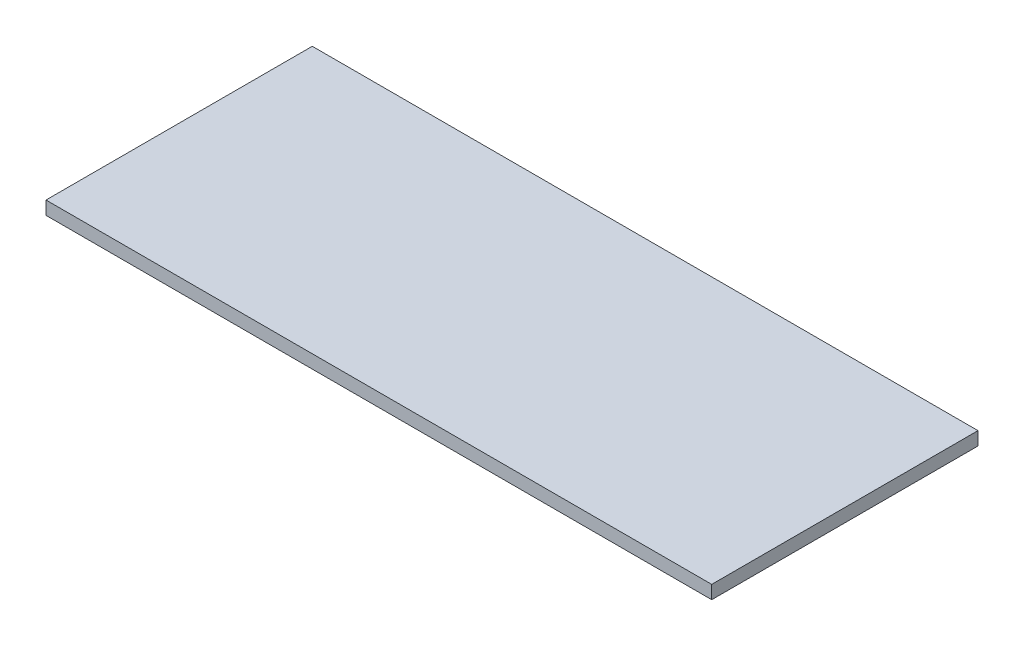
ISO-10303-21;
HEADER;
FILE_DESCRIPTION(('STEP AP214'),'2;1');
FILE_NAME('part.step','',(''),(''),'','','');
FILE_SCHEMA(('AUTOMOTIVE_DESIGN { 1 0 10303 214 1 1 1 1 }'));
ENDSEC;
DATA;
#1=APPLICATION_CONTEXT('core data for automotive mechanical design processes');
#2=APPLICATION_PROTOCOL_DEFINITION('international standard','automotive_design',2000,#1);
#3=PRODUCT_CONTEXT('',#1,'mechanical');
#4=PRODUCT('Part','Part','',(#3));
#5=PRODUCT_RELATED_PRODUCT_CATEGORY('part','',(#4));
#6=PRODUCT_DEFINITION_FORMATION('','',#4);
#7=PRODUCT_DEFINITION_CONTEXT('part definition',#1,'design');
#8=PRODUCT_DEFINITION('design','',#6,#7);
#9=PRODUCT_DEFINITION_SHAPE('','',#8);
#10=(LENGTH_UNIT() NAMED_UNIT(*) SI_UNIT(.MILLI.,.METRE.));
#11=(NAMED_UNIT(*) PLANE_ANGLE_UNIT() SI_UNIT($,.RADIAN.));
#12=(NAMED_UNIT(*) SI_UNIT($,.STERADIAN.) SOLID_ANGLE_UNIT());
#13=UNCERTAINTY_MEASURE_WITH_UNIT(LENGTH_MEASURE(1.E-05),#10,'distance_accuracy_value','');
#14=(GEOMETRIC_REPRESENTATION_CONTEXT(3) GLOBAL_UNCERTAINTY_ASSIGNED_CONTEXT((#13)) GLOBAL_UNIT_ASSIGNED_CONTEXT((#10,
#11,#12)) REPRESENTATION_CONTEXT('',''));
#15=CARTESIAN_POINT('',(0.,0.,0.));
#16=DIRECTION('',(0.,0.,1.));
#17=DIRECTION('',(1.,0.,0.));
#18=AXIS2_PLACEMENT_3D('',#15,#16,#17);
#19=CARTESIAN_POINT('',(100.,4.,40.));
#20=DIRECTION('',(-1.,0.,0.));
#21=DIRECTION('',(0.,0.,1.));
#22=AXIS2_PLACEMENT_3D('',#19,#20,#21);
#23=PLANE('',#22);
#24=DIRECTION('',(0.,0.,-1.));
#25=VECTOR('',#24,1.);
#26=CARTESIAN_POINT('',(100.,0.,40.));
#27=LINE('',#26,#25);
#28=CARTESIAN_POINT('',(100.,0.,40.));
#29=VERTEX_POINT('',#28);
#30=CARTESIAN_POINT('',(100.,0.,-40.));
#31=VERTEX_POINT('',#30);
#32=EDGE_CURVE('E98',#29,#31,#27,.T.);
#33=ORIENTED_EDGE('',*,*,#32,.T.);
#34=DIRECTION('',(0.,-1.,0.));
#35=VECTOR('',#34,1.);
#36=CARTESIAN_POINT('',(100.,4.,-40.));
#37=LINE('',#36,#35);
#38=CARTESIAN_POINT('',(100.,4.,-40.));
#39=VERTEX_POINT('',#38);
#40=EDGE_CURVE('E11',#39,#31,#37,.T.);
#41=ORIENTED_EDGE('',*,*,#40,.F.);
#42=DIRECTION('',(0.,0.,-1.));
#43=VECTOR('',#42,1.);
#44=CARTESIAN_POINT('',(100.,4.,40.));
#45=LINE('',#44,#43);
#46=CARTESIAN_POINT('',(100.,4.,40.));
#47=VERTEX_POINT('',#46);
#48=EDGE_CURVE('E86',#47,#39,#45,.T.);
#49=ORIENTED_EDGE('',*,*,#48,.F.);
#50=DIRECTION('',(0.,-1.,0.));
#51=VECTOR('',#50,1.);
#52=CARTESIAN_POINT('',(100.,4.,40.));
#53=LINE('',#52,#51);
#54=EDGE_CURVE('E94',#47,#29,#53,.T.);
#55=ORIENTED_EDGE('',*,*,#54,.T.);
#56=EDGE_LOOP('',(#33,#41,#49,#55));
#57=FACE_BOUND('',#56,.T.);
#58=ADVANCED_FACE('F35',(#57),#23,.F.);
#59=CARTESIAN_POINT('',(-99.9999999999999,4.,-40.));
#60=DIRECTION('',(0.,0.,1.));
#61=DIRECTION('',(1.,0.,0.));
#62=AXIS2_PLACEMENT_3D('',#59,#60,#61);
#63=PLANE('',#62);
#64=DIRECTION('',(-1.,0.,0.));
#65=VECTOR('',#64,1.);
#66=CARTESIAN_POINT('',(-99.9999999999999,0.,-40.));
#67=LINE('',#66,#65);
#68=CARTESIAN_POINT('',(-99.9999999999999,0.,-40.));
#69=VERTEX_POINT('',#68);
#70=EDGE_CURVE('E90',#31,#69,#67,.T.);
#71=ORIENTED_EDGE('',*,*,#70,.T.);
#72=DIRECTION('',(0.,-1.,0.));
#73=VECTOR('',#72,1.);
#74=CARTESIAN_POINT('',(-99.9999999999999,4.,-40.));
#75=LINE('',#74,#73);
#76=CARTESIAN_POINT('',(-99.9999999999999,4.,-40.));
#77=VERTEX_POINT('',#76);
#78=EDGE_CURVE('E43',#77,#69,#75,.T.);
#79=ORIENTED_EDGE('',*,*,#78,.F.);
#80=DIRECTION('',(-1.,0.,0.));
#81=VECTOR('',#80,1.);
#82=CARTESIAN_POINT('',(-99.9999999999999,4.,-40.));
#83=LINE('',#82,#81);
#84=EDGE_CURVE('E81',#39,#77,#83,.T.);
#85=ORIENTED_EDGE('',*,*,#84,.F.);
#86=ORIENTED_EDGE('',*,*,#40,.T.);
#87=EDGE_LOOP('',(#71,#79,#85,#86));
#88=FACE_BOUND('',#87,.T.);
#89=ADVANCED_FACE('F89',(#88),#63,.F.);
#90=CARTESIAN_POINT('',(-99.9999999999999,4.,40.));
#91=DIRECTION('',(1.,0.,0.));
#92=DIRECTION('',(0.,0.,-1.));
#93=AXIS2_PLACEMENT_3D('',#90,#91,#92);
#94=PLANE('',#93);
#95=DIRECTION('',(0.,0.,1.));
#96=VECTOR('',#95,1.);
#97=CARTESIAN_POINT('',(-99.9999999999999,0.,40.));
#98=LINE('',#97,#96);
#99=CARTESIAN_POINT('',(-99.9999999999999,0.,40.));
#100=VERTEX_POINT('',#99);
#101=EDGE_CURVE('E68',#69,#100,#98,.T.);
#102=ORIENTED_EDGE('',*,*,#101,.T.);
#103=DIRECTION('',(0.,-1.,0.));
#104=VECTOR('',#103,1.);
#105=CARTESIAN_POINT('',(-99.9999999999999,4.,40.));
#106=LINE('',#105,#104);
#107=CARTESIAN_POINT('',(-99.9999999999999,4.,40.));
#108=VERTEX_POINT('',#107);
#109=EDGE_CURVE('E91',#108,#100,#106,.T.);
#110=ORIENTED_EDGE('',*,*,#109,.F.);
#111=DIRECTION('',(0.,0.,1.));
#112=VECTOR('',#111,1.);
#113=CARTESIAN_POINT('',(-99.9999999999999,4.,40.));
#114=LINE('',#113,#112);
#115=EDGE_CURVE('E84',#77,#108,#114,.T.);
#116=ORIENTED_EDGE('',*,*,#115,.F.);
#117=ORIENTED_EDGE('',*,*,#78,.T.);
#118=EDGE_LOOP('',(#102,#110,#116,#117));
#119=FACE_BOUND('',#118,.T.);
#120=ADVANCED_FACE('F92',(#119),#94,.F.);
#121=CARTESIAN_POINT('',(-99.9999999999999,4.,40.));
#122=DIRECTION('',(0.,0.,-1.));
#123=DIRECTION('',(-1.,0.,0.));
#124=AXIS2_PLACEMENT_3D('',#121,#122,#123);
#125=PLANE('',#124);
#126=DIRECTION('',(1.,0.,0.));
#127=VECTOR('',#126,1.);
#128=CARTESIAN_POINT('',(-99.9999999999999,0.,40.));
#129=LINE('',#128,#127);
#130=EDGE_CURVE('E74',#100,#29,#129,.T.);
#131=ORIENTED_EDGE('',*,*,#130,.T.);
#132=ORIENTED_EDGE('',*,*,#54,.F.);
#133=DIRECTION('',(1.,0.,0.));
#134=VECTOR('',#133,1.);
#135=CARTESIAN_POINT('',(-99.9999999999999,4.,40.));
#136=LINE('',#135,#134);
#137=EDGE_CURVE('E51',#108,#47,#136,.T.);
#138=ORIENTED_EDGE('',*,*,#137,.F.);
#139=ORIENTED_EDGE('',*,*,#109,.T.);
#140=EDGE_LOOP('',(#131,#132,#138,#139));
#141=FACE_BOUND('',#140,.T.);
#142=ADVANCED_FACE('F105',(#141),#125,.F.);
#143=CARTESIAN_POINT('',(0.,4.,0.));
#144=DIRECTION('',(0.,-1.,0.));
#145=DIRECTION('',(0.,0.,-1.));
#146=AXIS2_PLACEMENT_3D('',#143,#144,#145);
#147=PLANE('',#146);
#148=ORIENTED_EDGE('',*,*,#48,.T.);
#149=ORIENTED_EDGE('',*,*,#84,.T.);
#150=ORIENTED_EDGE('',*,*,#115,.T.);
#151=ORIENTED_EDGE('',*,*,#137,.T.);
#152=EDGE_LOOP('',(#148,#149,#150,#151));
#153=FACE_BOUND('',#152,.T.);
#154=ADVANCED_FACE('F82',(#153),#147,.F.);
#155=CARTESIAN_POINT('',(0.,0.,0.));
#156=DIRECTION('',(0.,-1.,0.));
#157=DIRECTION('',(0.,0.,-1.));
#158=AXIS2_PLACEMENT_3D('',#155,#156,#157);
#159=PLANE('',#158);
#160=ORIENTED_EDGE('',*,*,#32,.F.);
#161=ORIENTED_EDGE('',*,*,#130,.F.);
#162=ORIENTED_EDGE('',*,*,#101,.F.);
#163=ORIENTED_EDGE('',*,*,#70,.F.);
#164=EDGE_LOOP('',(#160,#161,#162,#163));
#165=FACE_BOUND('',#164,.T.);
#166=ADVANCED_FACE('F108',(#165),#159,.T.);
#167=CLOSED_SHELL('',(#58,#89,#120,#142,#154,#166));
#168=MANIFOLD_SOLID_BREP('B2',#167);
#169=ADVANCED_BREP_SHAPE_REPRESENTATION('',(#18,#168),#14);
#170=SHAPE_DEFINITION_REPRESENTATION(#9,#169);
ENDSEC;
END-ISO-10303-21;
